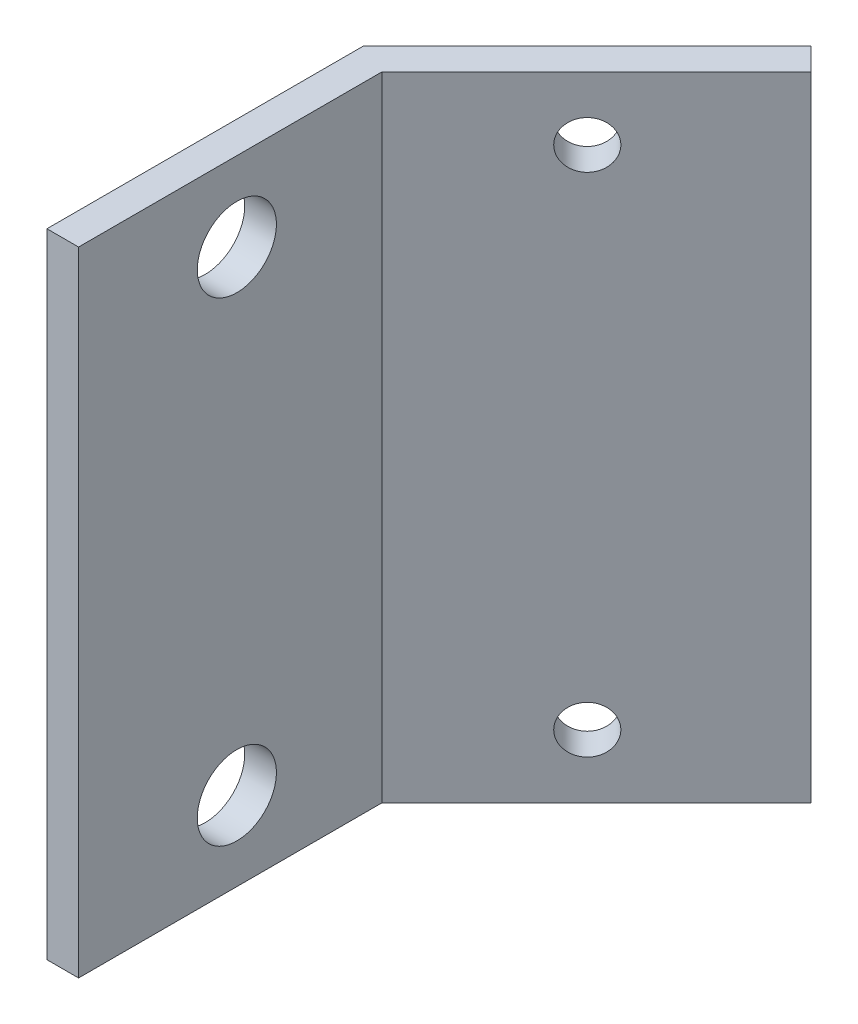
ISO-10303-21;
HEADER;
FILE_DESCRIPTION(('STEP AP214'),'2;1');
FILE_NAME('part.step','',(''),(''),'','','');
FILE_SCHEMA(('AUTOMOTIVE_DESIGN { 1 0 10303 214 1 1 1 1 }'));
ENDSEC;
DATA;
#1=APPLICATION_CONTEXT('core data for automotive mechanical design processes');
#2=APPLICATION_PROTOCOL_DEFINITION('international standard','automotive_design',2000,#1);
#3=PRODUCT_CONTEXT('',#1,'mechanical');
#4=PRODUCT('Part','Part','',(#3));
#5=PRODUCT_RELATED_PRODUCT_CATEGORY('part','',(#4));
#6=PRODUCT_DEFINITION_FORMATION('','',#4);
#7=PRODUCT_DEFINITION_CONTEXT('part definition',#1,'design');
#8=PRODUCT_DEFINITION('design','',#6,#7);
#9=PRODUCT_DEFINITION_SHAPE('','',#8);
#10=(LENGTH_UNIT() NAMED_UNIT(*) SI_UNIT(.MILLI.,.METRE.));
#11=(NAMED_UNIT(*) PLANE_ANGLE_UNIT() SI_UNIT($,.RADIAN.));
#12=(NAMED_UNIT(*) SI_UNIT($,.STERADIAN.) SOLID_ANGLE_UNIT());
#13=UNCERTAINTY_MEASURE_WITH_UNIT(LENGTH_MEASURE(1.E-05),#10,'distance_accuracy_value','');
#14=(GEOMETRIC_REPRESENTATION_CONTEXT(3) GLOBAL_UNCERTAINTY_ASSIGNED_CONTEXT((#13)) GLOBAL_UNIT_ASSIGNED_CONTEXT((#10,
#11,#12)) REPRESENTATION_CONTEXT('',''));
#15=CARTESIAN_POINT('',(0.,0.,0.));
#16=DIRECTION('',(0.,0.,1.));
#17=DIRECTION('',(1.,0.,0.));
#18=AXIS2_PLACEMENT_3D('',#15,#16,#17);
#19=CARTESIAN_POINT('',(2.,40.,0.));
#20=DIRECTION('',(0.,0.,-1.));
#21=DIRECTION('',(-1.,0.,0.));
#22=AXIS2_PLACEMENT_3D('',#19,#20,#21);
#23=PLANE('',#22);
#24=DIRECTION('',(1.,0.,0.));
#25=VECTOR('',#24,1.);
#26=CARTESIAN_POINT('',(2.,0.,0.));
#27=LINE('',#26,#25);
#28=CARTESIAN_POINT('',(0.,0.,0.));
#29=VERTEX_POINT('',#28);
#30=CARTESIAN_POINT('',(2.,0.,0.));
#31=VERTEX_POINT('',#30);
#32=EDGE_CURVE('E115',#29,#31,#27,.T.);
#33=ORIENTED_EDGE('',*,*,#32,.T.);
#34=DIRECTION('',(0.,-1.,0.));
#35=VECTOR('',#34,1.);
#36=CARTESIAN_POINT('',(2.,40.,0.));
#37=LINE('',#36,#35);
#38=CARTESIAN_POINT('',(2.,40.,0.));
#39=VERTEX_POINT('',#38);
#40=EDGE_CURVE('E11',#39,#31,#37,.T.);
#41=ORIENTED_EDGE('',*,*,#40,.F.);
#42=DIRECTION('',(1.,0.,0.));
#43=VECTOR('',#42,1.);
#44=CARTESIAN_POINT('',(2.,40.,0.));
#45=LINE('',#44,#43);
#46=CARTESIAN_POINT('',(0.,40.,0.));
#47=VERTEX_POINT('',#46);
#48=EDGE_CURVE('E126',#47,#39,#45,.T.);
#49=ORIENTED_EDGE('',*,*,#48,.F.);
#50=DIRECTION('',(0.,-1.,0.));
#51=VECTOR('',#50,1.);
#52=CARTESIAN_POINT('',(0.,40.,0.));
#53=LINE('',#52,#51);
#54=EDGE_CURVE('E111',#47,#29,#53,.T.);
#55=ORIENTED_EDGE('',*,*,#54,.T.);
#56=EDGE_LOOP('',(#33,#41,#49,#55));
#57=FACE_BOUND('',#56,.T.);
#58=ADVANCED_FACE('F31',(#57),#23,.F.);
#59=CARTESIAN_POINT('',(2.,40.,-19.1715728752538));
#60=DIRECTION('',(-1.,0.,0.));
#61=DIRECTION('',(0.,0.,1.));
#62=AXIS2_PLACEMENT_3D('',#59,#60,#61);
#63=PLANE('',#62);
#64=CARTESIAN_POINT('',(2.,35.,-10.));
#65=DIRECTION('',(-1.,0.,0.));
#66=DIRECTION('',(0.,0.,1.));
#67=AXIS2_PLACEMENT_3D('',#64,#65,#66);
#68=CIRCLE('',#67,2.5);
#69=CARTESIAN_POINT('',(2.,35.,-7.5));
#70=VERTEX_POINT('',#69);
#71=EDGE_CURVE('E260',#70,#70,#68,.F.);
#72=ORIENTED_EDGE('',*,*,#71,.F.);
#73=EDGE_LOOP('',(#72));
#74=FACE_BOUND('',#73,.T.);
#75=CARTESIAN_POINT('',(2.,5.,-10.));
#76=DIRECTION('',(-1.,0.,0.));
#77=DIRECTION('',(0.,0.,1.));
#78=AXIS2_PLACEMENT_3D('',#75,#76,#77);
#79=CIRCLE('',#78,2.5);
#80=CARTESIAN_POINT('',(2.,5.,-7.5));
#81=VERTEX_POINT('',#80);
#82=EDGE_CURVE('E119',#81,#81,#79,.F.);
#83=ORIENTED_EDGE('',*,*,#82,.F.);
#84=EDGE_LOOP('',(#83));
#85=FACE_BOUND('',#84,.T.);
#86=DIRECTION('',(0.,0.,-1.));
#87=VECTOR('',#86,1.);
#88=CARTESIAN_POINT('',(2.,0.,-19.1715728752538));
#89=LINE('',#88,#87);
#90=CARTESIAN_POINT('',(2.,0.,-19.1715728752538));
#91=VERTEX_POINT('',#90);
#92=EDGE_CURVE('E118',#31,#91,#89,.T.);
#93=ORIENTED_EDGE('',*,*,#92,.T.);
#94=DIRECTION('',(0.,-1.,0.));
#95=VECTOR('',#94,1.);
#96=CARTESIAN_POINT('',(2.,40.,-19.1715728752538));
#97=LINE('',#96,#95);
#98=CARTESIAN_POINT('',(2.,40.,-19.1715728752538));
#99=VERTEX_POINT('',#98);
#100=EDGE_CURVE('E39',#99,#91,#97,.T.);
#101=ORIENTED_EDGE('',*,*,#100,.F.);
#102=DIRECTION('',(0.,0.,-1.));
#103=VECTOR('',#102,1.);
#104=CARTESIAN_POINT('',(2.,40.,-19.1715728752538));
#105=LINE('',#104,#103);
#106=EDGE_CURVE('E84',#39,#99,#105,.T.);
#107=ORIENTED_EDGE('',*,*,#106,.F.);
#108=ORIENTED_EDGE('',*,*,#40,.T.);
#109=EDGE_LOOP('',(#93,#101,#107,#108));
#110=FACE_BOUND('',#109,.T.);
#111=ADVANCED_FACE('F154',(#74,#85,#110),#63,.F.);
#112=CARTESIAN_POINT('',(15.5563491861041,40.,-32.7279220613578));
#113=DIRECTION('',(-0.707106781186546,0.,-0.707106781186549));
#114=DIRECTION('',(-0.707106781186549,0.,0.707106781186546));
#115=AXIS2_PLACEMENT_3D('',#112,#113,#114);
#116=PLANE('',#115);
#117=CARTESIAN_POINT('',(8.48528137423858,4.,-25.6568542494924));
#118=DIRECTION('',(-0.707106781186546,0.,-0.707106781186549));
#119=DIRECTION('',(-0.707106781186549,0.,0.707106781186546));
#120=AXIS2_PLACEMENT_3D('',#117,#118,#119);
#121=CIRCLE('',#120,1.5);
#122=CARTESIAN_POINT('',(7.42462120245876,4.,-24.5961940777125));
#123=VERTEX_POINT('',#122);
#124=EDGE_CURVE('E276',#123,#123,#121,.F.);
#125=ORIENTED_EDGE('',*,*,#124,.F.);
#126=EDGE_LOOP('',(#125));
#127=FACE_BOUND('',#126,.T.);
#128=CARTESIAN_POINT('',(8.48528137423858,36.,-25.6568542494924));
#129=DIRECTION('',(-0.707106781186546,0.,-0.707106781186549));
#130=DIRECTION('',(-0.707106781186549,0.,0.707106781186546));
#131=AXIS2_PLACEMENT_3D('',#128,#129,#130);
#132=CIRCLE('',#131,1.5);
#133=CARTESIAN_POINT('',(7.42462120245876,36.,-24.5961940777125));
#134=VERTEX_POINT('',#133);
#135=EDGE_CURVE('E270',#134,#134,#132,.F.);
#136=ORIENTED_EDGE('',*,*,#135,.F.);
#137=EDGE_LOOP('',(#136));
#138=FACE_BOUND('',#137,.T.);
#139=DIRECTION('',(0.707106781186549,0.,-0.707106781186546));
#140=VECTOR('',#139,1.);
#141=CARTESIAN_POINT('',(15.5563491861041,0.,-32.7279220613578));
#142=LINE('',#141,#140);
#143=CARTESIAN_POINT('',(15.5563491861041,0.,-32.7279220613578));
#144=VERTEX_POINT('',#143);
#145=EDGE_CURVE('E121',#91,#144,#142,.T.);
#146=ORIENTED_EDGE('',*,*,#145,.T.);
#147=DIRECTION('',(0.,-1.,0.));
#148=VECTOR('',#147,1.);
#149=CARTESIAN_POINT('',(15.5563491861041,40.,-32.7279220613578));
#150=LINE('',#149,#148);
#151=CARTESIAN_POINT('',(15.5563491861041,40.,-32.7279220613578));
#152=VERTEX_POINT('',#151);
#153=EDGE_CURVE('E106',#152,#144,#150,.T.);
#154=ORIENTED_EDGE('',*,*,#153,.F.);
#155=DIRECTION('',(0.707106781186549,0.,-0.707106781186546));
#156=VECTOR('',#155,1.);
#157=CARTESIAN_POINT('',(15.5563491861041,40.,-32.7279220613578));
#158=LINE('',#157,#156);
#159=EDGE_CURVE('E97',#99,#152,#158,.T.);
#160=ORIENTED_EDGE('',*,*,#159,.F.);
#161=ORIENTED_EDGE('',*,*,#100,.T.);
#162=EDGE_LOOP('',(#146,#154,#160,#161));
#163=FACE_BOUND('',#162,.T.);
#164=ADVANCED_FACE('F132',(#127,#138,#163),#116,.F.);
#165=CARTESIAN_POINT('',(14.142135623731,40.,-34.1421356237309));
#166=DIRECTION('',(-0.707106781186549,0.,0.707106781186546));
#167=DIRECTION('',(0.707106781186546,0.,0.707106781186549));
#168=AXIS2_PLACEMENT_3D('',#165,#166,#167);
#169=PLANE('',#168);
#170=DIRECTION('',(-0.707106781186546,0.,-0.707106781186549));
#171=VECTOR('',#170,1.);
#172=CARTESIAN_POINT('',(14.142135623731,0.,-34.1421356237309));
#173=LINE('',#172,#171);
#174=CARTESIAN_POINT('',(14.142135623731,0.,-34.1421356237309));
#175=VERTEX_POINT('',#174);
#176=EDGE_CURVE('E105',#144,#175,#173,.T.);
#177=ORIENTED_EDGE('',*,*,#176,.T.);
#178=DIRECTION('',(0.,-1.,0.));
#179=VECTOR('',#178,1.);
#180=CARTESIAN_POINT('',(14.142135623731,40.,-34.1421356237309));
#181=LINE('',#180,#179);
#182=CARTESIAN_POINT('',(14.142135623731,40.,-34.1421356237309));
#183=VERTEX_POINT('',#182);
#184=EDGE_CURVE('E102',#183,#175,#181,.T.);
#185=ORIENTED_EDGE('',*,*,#184,.F.);
#186=DIRECTION('',(-0.707106781186546,0.,-0.707106781186549));
#187=VECTOR('',#186,1.);
#188=CARTESIAN_POINT('',(14.142135623731,40.,-34.1421356237309));
#189=LINE('',#188,#187);
#190=EDGE_CURVE('E91',#152,#183,#189,.T.);
#191=ORIENTED_EDGE('',*,*,#190,.F.);
#192=ORIENTED_EDGE('',*,*,#153,.T.);
#193=EDGE_LOOP('',(#177,#185,#191,#192));
#194=FACE_BOUND('',#193,.T.);
#195=ADVANCED_FACE('F103',(#194),#169,.F.);
#196=CARTESIAN_POINT('',(0.,40.,-20.));
#197=DIRECTION('',(0.707106781186546,0.,0.707106781186549));
#198=DIRECTION('',(0.707106781186549,0.,-0.707106781186546));
#199=AXIS2_PLACEMENT_3D('',#196,#197,#198);
#200=PLANE('',#199);
#201=CARTESIAN_POINT('',(7.07106781186548,4.,-27.0710678118655));
#202=DIRECTION('',(-0.707106781186546,0.,-0.707106781186549));
#203=DIRECTION('',(0.707106781186549,0.,-0.707106781186546));
#204=AXIS2_PLACEMENT_3D('',#201,#202,#203);
#205=CIRCLE('',#204,1.5);
#206=CARTESIAN_POINT('',(8.13172798364531,4.,-28.1317279836453));
#207=VERTEX_POINT('',#206);
#208=EDGE_CURVE('E279',#207,#207,#205,.T.);
#209=ORIENTED_EDGE('',*,*,#208,.F.);
#210=EDGE_LOOP('',(#209));
#211=FACE_BOUND('',#210,.T.);
#212=CARTESIAN_POINT('',(7.07106781186548,36.,-27.0710678118655));
#213=DIRECTION('',(-0.707106781186546,0.,-0.707106781186549));
#214=DIRECTION('',(-0.707106781186549,0.,0.707106781186546));
#215=AXIS2_PLACEMENT_3D('',#212,#213,#214);
#216=CIRCLE('',#215,1.5);
#217=CARTESIAN_POINT('',(6.01040764008566,36.,-26.0104076400856));
#218=VERTEX_POINT('',#217);
#219=EDGE_CURVE('E273',#218,#218,#216,.T.);
#220=ORIENTED_EDGE('',*,*,#219,.F.);
#221=EDGE_LOOP('',(#220));
#222=FACE_BOUND('',#221,.T.);
#223=DIRECTION('',(-0.707106781186549,0.,0.707106781186546));
#224=VECTOR('',#223,1.);
#225=CARTESIAN_POINT('',(0.,0.,-20.));
#226=LINE('',#225,#224);
#227=CARTESIAN_POINT('',(0.,0.,-20.));
#228=VERTEX_POINT('',#227);
#229=EDGE_CURVE('E70',#175,#228,#226,.T.);
#230=ORIENTED_EDGE('',*,*,#229,.T.);
#231=DIRECTION('',(0.,-1.,0.));
#232=VECTOR('',#231,1.);
#233=CARTESIAN_POINT('',(0.,40.,-20.));
#234=LINE('',#233,#232);
#235=CARTESIAN_POINT('',(0.,40.,-20.));
#236=VERTEX_POINT('',#235);
#237=EDGE_CURVE('E107',#236,#228,#234,.T.);
#238=ORIENTED_EDGE('',*,*,#237,.F.);
#239=DIRECTION('',(-0.707106781186549,0.,0.707106781186546));
#240=VECTOR('',#239,1.);
#241=CARTESIAN_POINT('',(0.,40.,-20.));
#242=LINE('',#241,#240);
#243=EDGE_CURVE('E95',#183,#236,#242,.T.);
#244=ORIENTED_EDGE('',*,*,#243,.F.);
#245=ORIENTED_EDGE('',*,*,#184,.T.);
#246=EDGE_LOOP('',(#230,#238,#244,#245));
#247=FACE_BOUND('',#246,.T.);
#248=ADVANCED_FACE('F109',(#211,#222,#247),#200,.F.);
#249=CARTESIAN_POINT('',(0.,40.,0.));
#250=DIRECTION('',(1.,0.,0.));
#251=DIRECTION('',(0.,0.,-1.));
#252=AXIS2_PLACEMENT_3D('',#249,#250,#251);
#253=PLANE('',#252);
#254=CARTESIAN_POINT('',(0.,35.,-10.));
#255=DIRECTION('',(-1.,0.,0.));
#256=DIRECTION('',(0.,0.,-1.));
#257=AXIS2_PLACEMENT_3D('',#254,#255,#256);
#258=CIRCLE('',#257,2.5);
#259=CARTESIAN_POINT('',(0.,35.,-12.5));
#260=VERTEX_POINT('',#259);
#261=EDGE_CURVE('E267',#260,#260,#258,.T.);
#262=ORIENTED_EDGE('',*,*,#261,.F.);
#263=EDGE_LOOP('',(#262));
#264=FACE_BOUND('',#263,.T.);
#265=CARTESIAN_POINT('',(0.,5.,-10.));
#266=DIRECTION('',(-1.,0.,0.));
#267=DIRECTION('',(0.,0.,1.));
#268=AXIS2_PLACEMENT_3D('',#265,#266,#267);
#269=CIRCLE('',#268,2.5);
#270=CARTESIAN_POINT('',(0.,5.,-7.5));
#271=VERTEX_POINT('',#270);
#272=EDGE_CURVE('E256',#271,#271,#269,.T.);
#273=ORIENTED_EDGE('',*,*,#272,.F.);
#274=EDGE_LOOP('',(#273));
#275=FACE_BOUND('',#274,.T.);
#276=DIRECTION('',(0.,0.,1.));
#277=VECTOR('',#276,1.);
#278=CARTESIAN_POINT('',(0.,0.,0.));
#279=LINE('',#278,#277);
#280=EDGE_CURVE('E76',#228,#29,#279,.T.);
#281=ORIENTED_EDGE('',*,*,#280,.T.);
#282=ORIENTED_EDGE('',*,*,#54,.F.);
#283=DIRECTION('',(0.,0.,1.));
#284=VECTOR('',#283,1.);
#285=CARTESIAN_POINT('',(0.,40.,0.));
#286=LINE('',#285,#284);
#287=EDGE_CURVE('E47',#236,#47,#286,.T.);
#288=ORIENTED_EDGE('',*,*,#287,.F.);
#289=ORIENTED_EDGE('',*,*,#237,.T.);
#290=EDGE_LOOP('',(#281,#282,#288,#289));
#291=FACE_BOUND('',#290,.T.);
#292=ADVANCED_FACE('F139',(#264,#275,#291),#253,.F.);
#293=CARTESIAN_POINT('',(0.,40.,0.));
#294=DIRECTION('',(0.,-1.,0.));
#295=DIRECTION('',(0.,0.,-1.));
#296=AXIS2_PLACEMENT_3D('',#293,#294,#295);
#297=PLANE('',#296);
#298=ORIENTED_EDGE('',*,*,#48,.T.);
#299=ORIENTED_EDGE('',*,*,#106,.T.);
#300=ORIENTED_EDGE('',*,*,#159,.T.);
#301=ORIENTED_EDGE('',*,*,#190,.T.);
#302=ORIENTED_EDGE('',*,*,#243,.T.);
#303=ORIENTED_EDGE('',*,*,#287,.T.);
#304=EDGE_LOOP('',(#298,#299,#300,#301,#302,#303));
#305=FACE_BOUND('',#304,.T.);
#306=ADVANCED_FACE('F93',(#305),#297,.F.);
#307=CARTESIAN_POINT('',(0.,0.,0.));
#308=DIRECTION('',(0.,-1.,0.));
#309=DIRECTION('',(0.,0.,-1.));
#310=AXIS2_PLACEMENT_3D('',#307,#308,#309);
#311=PLANE('',#310);
#312=ORIENTED_EDGE('',*,*,#32,.F.);
#313=ORIENTED_EDGE('',*,*,#280,.F.);
#314=ORIENTED_EDGE('',*,*,#229,.F.);
#315=ORIENTED_EDGE('',*,*,#176,.F.);
#316=ORIENTED_EDGE('',*,*,#145,.F.);
#317=ORIENTED_EDGE('',*,*,#92,.F.);
#318=EDGE_LOOP('',(#312,#313,#314,#315,#316,#317));
#319=FACE_BOUND('',#318,.T.);
#320=ADVANCED_FACE('F135',(#319),#311,.T.);
#321=CARTESIAN_POINT('',(15.5573491861041,5.,-10.));
#322=DIRECTION('',(-1.,0.,0.));
#323=DIRECTION('',(0.,0.,1.));
#324=AXIS2_PLACEMENT_3D('',#321,#322,#323);
#325=CYLINDRICAL_SURFACE('',#324,2.5);
#326=ORIENTED_EDGE('',*,*,#272,.T.);
#327=EDGE_LOOP('',(#326));
#328=FACE_BOUND('',#327,.T.);
#329=ORIENTED_EDGE('',*,*,#82,.T.);
#330=EDGE_LOOP('',(#329));
#331=FACE_BOUND('',#330,.T.);
#332=ADVANCED_FACE('F212',(#328,#331),#325,.F.);
#333=CARTESIAN_POINT('',(15.5573491861041,35.,-10.));
#334=DIRECTION('',(-1.,0.,0.));
#335=DIRECTION('',(0.,0.,1.));
#336=AXIS2_PLACEMENT_3D('',#333,#334,#335);
#337=CYLINDRICAL_SURFACE('',#336,2.5);
#338=ORIENTED_EDGE('',*,*,#261,.T.);
#339=EDGE_LOOP('',(#338));
#340=FACE_BOUND('',#339,.T.);
#341=ORIENTED_EDGE('',*,*,#71,.T.);
#342=EDGE_LOOP('',(#341));
#343=FACE_BOUND('',#342,.T.);
#344=ADVANCED_FACE('F192',(#340,#343),#337,.F.);
#345=CARTESIAN_POINT('',(24.8502424049175,36.,-9.2918932188134));
#346=DIRECTION('',(-0.707106781186546,0.,-0.707106781186549));
#347=DIRECTION('',(-0.707106781186549,0.,0.707106781186546));
#348=AXIS2_PLACEMENT_3D('',#345,#346,#347);
#349=CYLINDRICAL_SURFACE('',#348,1.5);
#350=ORIENTED_EDGE('',*,*,#219,.T.);
#351=EDGE_LOOP('',(#350));
#352=FACE_BOUND('',#351,.T.);
#353=ORIENTED_EDGE('',*,*,#135,.T.);
#354=EDGE_LOOP('',(#353));
#355=FACE_BOUND('',#354,.T.);
#356=ADVANCED_FACE('F186',(#352,#355),#349,.F.);
#357=CARTESIAN_POINT('',(24.8502424049175,4.,-9.2918932188134));
#358=DIRECTION('',(-0.707106781186546,0.,-0.707106781186549));
#359=DIRECTION('',(-0.707106781186549,0.,0.707106781186546));
#360=AXIS2_PLACEMENT_3D('',#357,#358,#359);
#361=CYLINDRICAL_SURFACE('',#360,1.5);
#362=ORIENTED_EDGE('',*,*,#208,.T.);
#363=EDGE_LOOP('',(#362));
#364=FACE_BOUND('',#363,.T.);
#365=ORIENTED_EDGE('',*,*,#124,.T.);
#366=EDGE_LOOP('',(#365));
#367=FACE_BOUND('',#366,.T.);
#368=ADVANCED_FACE('F191',(#364,#367),#361,.F.);
#369=CLOSED_SHELL('',(#58,#111,#164,#195,#248,#292,#306,#320,#332,#344,#356,#368));
#370=MANIFOLD_SOLID_BREP('B2',#369);
#371=ADVANCED_BREP_SHAPE_REPRESENTATION('',(#18,#370),#14);
#372=SHAPE_DEFINITION_REPRESENTATION(#9,#371);
ENDSEC;
END-ISO-10303-21;
